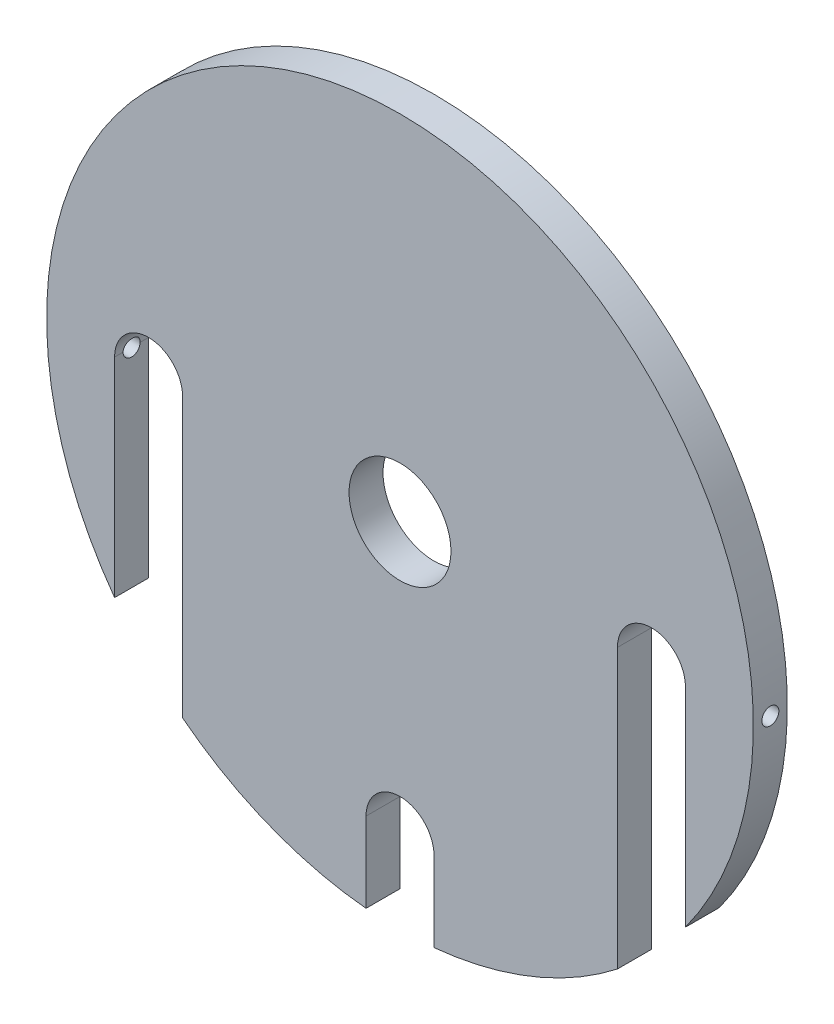
ISO-10303-21;
HEADER;
FILE_DESCRIPTION(('STEP AP214'),'2;1');
FILE_NAME('part.step','',(''),(''),'','','');
FILE_SCHEMA(('AUTOMOTIVE_DESIGN { 1 0 10303 214 1 1 1 1 }'));
ENDSEC;
DATA;
#1=APPLICATION_CONTEXT('core data for automotive mechanical design processes');
#2=APPLICATION_PROTOCOL_DEFINITION('international standard','automotive_design',2000,#1);
#3=PRODUCT_CONTEXT('',#1,'mechanical');
#4=PRODUCT('Part','Part','',(#3));
#5=PRODUCT_RELATED_PRODUCT_CATEGORY('part','',(#4));
#6=PRODUCT_DEFINITION_FORMATION('','',#4);
#7=PRODUCT_DEFINITION_CONTEXT('part definition',#1,'design');
#8=PRODUCT_DEFINITION('design','',#6,#7);
#9=PRODUCT_DEFINITION_SHAPE('','',#8);
#10=(LENGTH_UNIT() NAMED_UNIT(*) SI_UNIT(.MILLI.,.METRE.));
#11=(NAMED_UNIT(*) PLANE_ANGLE_UNIT() SI_UNIT($,.RADIAN.));
#12=(NAMED_UNIT(*) SI_UNIT($,.STERADIAN.) SOLID_ANGLE_UNIT());
#13=UNCERTAINTY_MEASURE_WITH_UNIT(LENGTH_MEASURE(1.E-05),#10,'distance_accuracy_value','');
#14=(GEOMETRIC_REPRESENTATION_CONTEXT(3) GLOBAL_UNCERTAINTY_ASSIGNED_CONTEXT((#13)) GLOBAL_UNIT_ASSIGNED_CONTEXT((#10,
#11,#12)) REPRESENTATION_CONTEXT('',''));
#15=CARTESIAN_POINT('',(0.,0.,0.));
#16=DIRECTION('',(0.,0.,1.));
#17=DIRECTION('',(1.,0.,0.));
#18=AXIS2_PLACEMENT_3D('',#15,#16,#17);
#19=CARTESIAN_POINT('',(0.,0.,5.));
#20=DIRECTION('',(0.,0.,-1.));
#21=DIRECTION('',(-1.,0.,0.));
#22=AXIS2_PLACEMENT_3D('',#19,#20,#21);
#23=CYLINDRICAL_SURFACE('',#22,52.);
#24=CARTESIAN_POINT('',(-52.,0.,3.74999999999997));
#25=CARTESIAN_POINT('',(-51.9999997973088,-0.0702021682400464,3.74999687992933));
#26=CARTESIAN_POINT('',(-51.9998563106322,-0.140454980639137,3.74406611765067));
#27=CARTESIAN_POINT('',(-51.9992977077108,-0.279025058393827,3.72048986893196));
#28=CARTESIAN_POINT('',(-51.9988822661217,-0.347339903067153,3.70283035081474));
#29=CARTESIAN_POINT('',(-51.9978268064074,-0.480006508188222,3.65630027639843));
#30=CARTESIAN_POINT('',(-51.99718689723,-0.544360173457295,3.62743515813433));
#31=CARTESIAN_POINT('',(-51.9957547051507,-0.667290304712366,3.5593209406979));
#32=CARTESIAN_POINT('',(-51.9949624597062,-0.725868185533344,3.5200743932767));
#33=CARTESIAN_POINT('',(-51.993314512565,-0.835622237615812,3.43229506993562));
#34=CARTESIAN_POINT('',(-51.9924587928453,-0.886796294336812,3.38375965026051));
#35=CARTESIAN_POINT('',(-51.9907805029649,-0.980272412733882,3.27878450935077));
#36=CARTESIAN_POINT('',(-51.9899579341188,-1.02257412284458,3.22234447504473));
#37=CARTESIAN_POINT('',(-51.9884386397818,-1.09710649502679,3.10315638642818));
#38=CARTESIAN_POINT('',(-51.9877419271968,-1.1293361245001,3.04040768621896));
#39=CARTESIAN_POINT('',(-51.9865530421198,-1.18280263413753,2.91038812575776));
#40=CARTESIAN_POINT('',(-51.986060868954,-1.2040395505159,2.84311728040431));
#41=CARTESIAN_POINT('',(-51.9853366693591,-1.23491389903223,2.70597678620698));
#42=CARTESIAN_POINT('',(-51.9851045924863,-1.24455358038817,2.63610764399878));
#43=CARTESIAN_POINT('',(-51.984926600554,-1.25196674319694,2.49574247865659));
#44=CARTESIAN_POINT('',(-51.9849806845764,-1.24974026271388,2.42524645753422));
#45=CARTESIAN_POINT('',(-51.9853688684599,-1.2334862311866,2.28564392519228));
#46=CARTESIAN_POINT('',(-51.9857029104753,-1.21946111800725,2.21653712994719));
#47=CARTESIAN_POINT('',(-51.9866132614739,-1.18001170891155,2.08165919058869));
#48=CARTESIAN_POINT('',(-51.9871895708913,-1.15458739256979,2.01588805245243));
#49=CARTESIAN_POINT('',(-51.9885195538747,-1.09305848724996,1.88954063363324));
#50=CARTESIAN_POINT('',(-51.9892732460073,-1.05695278015017,1.82896489765869));
#51=CARTESIAN_POINT('',(-51.9908730077096,-0.97508685050708,1.71473380837822));
#52=CARTESIAN_POINT('',(-51.9917190774014,-0.929326615196248,1.66107846422425));
#53=CARTESIAN_POINT('',(-51.9934084710292,-0.829436795191524,1.56219702559578));
#54=CARTESIAN_POINT('',(-51.9942517942158,-0.775305094379052,1.5169730687793));
#55=CARTESIAN_POINT('',(-51.9958404163556,-0.66021642734381,1.43625461494275));
#56=CARTESIAN_POINT('',(-51.9965857152941,-0.599259460100227,1.40076011937787));
#57=CARTESIAN_POINT('',(-51.9978942759528,-0.472249452633566,1.34050840716626));
#58=CARTESIAN_POINT('',(-51.9984575365614,-0.406196381297413,1.31575125607999));
#59=CARTESIAN_POINT('',(-51.999338504944,-0.270869723303465,1.27767836334556));
#60=CARTESIAN_POINT('',(-51.999656213151,-0.2015961423257,1.26436260151896));
#61=CARTESIAN_POINT('',(-52.0000102063582,-0.061813484909492,1.24955309245813));
#62=CARTESIAN_POINT('',(-52.0000465617606,0.00869527802579338,1.24805638776463));
#63=CARTESIAN_POINT('',(-51.9998339373793,0.148963101488766,1.2569197746246));
#64=CARTESIAN_POINT('',(-51.9995849578032,0.218722162561868,1.26727985755157));
#65=CARTESIAN_POINT('',(-51.9988297727829,0.355502118047405,1.29956028456227));
#66=CARTESIAN_POINT('',(-51.9983235971799,0.422523329145396,1.32147928752947));
#67=CARTESIAN_POINT('',(-51.9971110688426,0.551934790106642,1.37625398512122));
#68=CARTESIAN_POINT('',(-51.9964047158591,0.614325034204478,1.40910969336138));
#69=CARTESIAN_POINT('',(-51.9948712519192,0.732717131318693,1.48483276088721));
#70=CARTESIAN_POINT('',(-51.9940441169541,0.788717710263129,1.52770211167582));
#71=CARTESIAN_POINT('',(-51.9923623996813,0.892728024943149,1.62223262873549));
#72=CARTESIAN_POINT('',(-51.9915078173245,0.940737746423562,1.67389381069027));
#73=CARTESIAN_POINT('',(-51.9898673476523,1.02741336637545,1.78455416895));
#74=CARTESIAN_POINT('',(-51.9890814743874,1.06607735654153,1.84355484018678));
#75=CARTESIAN_POINT('',(-51.9876672469856,1.1329509148134,1.96721168227525));
#76=CARTESIAN_POINT('',(-51.987038892561,1.16116050200276,2.03186784280308));
#77=CARTESIAN_POINT('',(-51.9860106472865,1.20632115233112,2.16499310229294));
#78=CARTESIAN_POINT('',(-51.9856107312901,1.22327345470781,2.2334617806612));
#79=CARTESIAN_POINT('',(-51.9850843807901,1.24544238931521,2.37227450012035));
#80=CARTESIAN_POINT('',(-51.9849579463086,1.25065902059229,2.44261854136364));
#81=CARTESIAN_POINT('',(-51.9849928232249,1.24920837205708,2.58316596950844));
#82=CARTESIAN_POINT('',(-51.9851540615811,1.24254410886215,2.65336938758407));
#83=CARTESIAN_POINT('',(-51.9857459536922,1.21752703248411,2.79166069234159));
#84=CARTESIAN_POINT('',(-51.9861766079842,1.19917419599695,2.85974857480534));
#85=CARTESIAN_POINT('',(-51.987258775318,1.15130120148205,2.9918775864388));
#86=CARTESIAN_POINT('',(-51.9879102922615,1.12178084616813,3.05591864409367));
#87=CARTESIAN_POINT('',(-51.9893607059864,1.05241228363552,3.17813395549261));
#88=CARTESIAN_POINT('',(-51.9901595972744,1.01256446135625,3.2363084277918));
#89=CARTESIAN_POINT('',(-51.9918148774004,0.923664953375486,3.34515199363518));
#90=CARTESIAN_POINT('',(-51.9926712747011,0.874611911118666,3.39581997899113));
#91=CARTESIAN_POINT('',(-51.9943451600046,0.768681430122398,3.48821510346305));
#92=CARTESIAN_POINT('',(-51.9951626383074,0.711802054372354,3.52994002261884));
#93=CARTESIAN_POINT('',(-51.9966667559422,0.591815694736752,3.60326923068736));
#94=CARTESIAN_POINT('',(-51.9973533182103,0.528705075788599,3.6348675659721));
#95=CARTESIAN_POINT('',(-51.9985167522864,0.398121943458331,3.68698349979239));
#96=CARTESIAN_POINT('',(-51.9989938744938,0.330654750008821,3.70751433698225));
#97=CARTESIAN_POINT('',(-51.9995568847121,0.218966675963328,3.73146049353979));
#98=CARTESIAN_POINT('',(-51.9997223338047,0.175471024400522,3.7384040917347));
#99=CARTESIAN_POINT('',(-51.9999439549651,0.0879902148647551,3.747674822414));
#100=CARTESIAN_POINT('',(-52.0000001270536,0.0440050569835983,3.75000195576416));
#101=CARTESIAN_POINT('',(-52.,0.,3.74999999999997));
#102=B_SPLINE_CURVE_WITH_KNOTS('',3,(#24,#25,#26,#27,#28,#29,#30,#31,#32,#33,#34,#35,#36,#37,
#38,#39,#40,#41,#42,#43,#44,#45,#46,#47,#48,#49,#50,#51,#52,#53,#54,#55,#56,#57,#58,#59,#60,#61,
#62,#63,#64,#65,#66,#67,#68,#69,#70,#71,#72,#73,#74,#75,#76,#77,#78,#79,#80,#81,#82,#83,#84,#85,
#86,#87,#88,#89,#90,#91,#92,#93,#94,#95,#96,#97,#98,#99,#100,#101),.UNSPECIFIED.,.T.,.F.,(4,2,2,
2,2,2,2,2,2,2,2,2,2,2,2,2,2,2,2,2,2,2,2,2,2,2,2,2,2,2,2,2,2,2,2,2,2,2,4),(0.,0.210445882642419,
0.421143986460032,0.631739966859021,0.842284230874119,1.05288850836603,1.26350112944419,
1.47413533562782,1.68476884789616,1.89536150239966,2.1059534813672,2.31650195794423,
2.52705081178931,2.73762171356832,2.94819289381639,3.15881738899728,3.36944191567997,
3.58006772838335,3.79069316961885,4.00126590479645,4.21183848677015,4.42238664256405,
4.63293506047981,4.84352538775412,5.05411609070383,5.26474975792468,5.47538304065057,
5.68599313234982,5.89660324116312,6.10715988265278,6.3177169439403,6.5282777251176,
6.73883065911478,6.94941464628901,7.16005084687811,7.37081065862462,7.58131780235904,
7.71323231478191,7.84514680246522),.UNSPECIFIED.);
#103=CARTESIAN_POINT('',(-52.,0.,3.74999999999997));
#104=VERTEX_POINT('',#103);
#105=EDGE_CURVE('E151',#104,#104,#102,.T.);
#106=ORIENTED_EDGE('',*,*,#105,.T.);
#107=EDGE_LOOP('',(#106));
#108=FACE_BOUND('',#107,.T.);
#109=CARTESIAN_POINT('',(52.,0.,1.25000000000002));
#110=CARTESIAN_POINT('',(51.9999997973088,-0.0702021682400463,1.25000312007066));
#111=CARTESIAN_POINT('',(51.9998563106322,-0.140454980639137,1.25593388234932));
#112=CARTESIAN_POINT('',(51.9992977077108,-0.279025058393826,1.27951013106803));
#113=CARTESIAN_POINT('',(51.9988822661217,-0.347339903067152,1.29716964918525));
#114=CARTESIAN_POINT('',(51.9978268064074,-0.480006508188221,1.34369972360156));
#115=CARTESIAN_POINT('',(51.99718689723,-0.544360173457294,1.37256484186566));
#116=CARTESIAN_POINT('',(51.9957547051507,-0.667290304712365,1.44067905930209));
#117=CARTESIAN_POINT('',(51.9949624597062,-0.725868185533343,1.47992560672329));
#118=CARTESIAN_POINT('',(51.993314512565,-0.83562223761581,1.56770493006437));
#119=CARTESIAN_POINT('',(51.9924587928453,-0.88679629433681,1.61624034973948));
#120=CARTESIAN_POINT('',(51.9907805029649,-0.980272412733881,1.72121549064922));
#121=CARTESIAN_POINT('',(51.9899579341188,-1.02257412284458,1.77765552495526));
#122=CARTESIAN_POINT('',(51.9884386397818,-1.09710649502679,1.89684361357181));
#123=CARTESIAN_POINT('',(51.9877419271968,-1.1293361245001,1.95959231378103));
#124=CARTESIAN_POINT('',(51.9865530421198,-1.18280263413752,2.08961187424223));
#125=CARTESIAN_POINT('',(51.986060868954,-1.2040395505159,2.15688271959568));
#126=CARTESIAN_POINT('',(51.9853366693591,-1.23491389903222,2.294023213793));
#127=CARTESIAN_POINT('',(51.9851045924863,-1.24455358038817,2.36389235600121));
#128=CARTESIAN_POINT('',(51.984926600554,-1.25196674319694,2.5042575213434));
#129=CARTESIAN_POINT('',(51.9849806845764,-1.24974026271388,2.57475354246577));
#130=CARTESIAN_POINT('',(51.9853688684599,-1.2334862311866,2.7143560748077));
#131=CARTESIAN_POINT('',(51.9857029104753,-1.21946111800725,2.78346287005279));
#132=CARTESIAN_POINT('',(51.9866132614739,-1.18001170891155,2.9183408094113));
#133=CARTESIAN_POINT('',(51.9871895708913,-1.15458739256979,2.98411194754756));
#134=CARTESIAN_POINT('',(51.9885195538747,-1.09305848724996,3.11045936636675));
#135=CARTESIAN_POINT('',(51.9892732460073,-1.05695278015017,3.1710351023413));
#136=CARTESIAN_POINT('',(51.9908730077096,-0.97508685050708,3.28526619162177));
#137=CARTESIAN_POINT('',(51.9917190774014,-0.929326615196247,3.33892153577574));
#138=CARTESIAN_POINT('',(51.9934084710292,-0.829436795191523,3.4378029744042));
#139=CARTESIAN_POINT('',(51.9942517942158,-0.775305094379052,3.48302693122069));
#140=CARTESIAN_POINT('',(51.9958404163556,-0.66021642734381,3.56374538505724));
#141=CARTESIAN_POINT('',(51.9965857152941,-0.599259460100227,3.59923988062212));
#142=CARTESIAN_POINT('',(51.9978942759528,-0.472249452633566,3.65949159283373));
#143=CARTESIAN_POINT('',(51.9984575365614,-0.406196381297413,3.68424874392));
#144=CARTESIAN_POINT('',(51.999338504944,-0.270869723303465,3.72232163665443));
#145=CARTESIAN_POINT('',(51.9996562131511,-0.201596142325701,3.73563739848103));
#146=CARTESIAN_POINT('',(52.0000102063582,-0.0618134849094924,3.75044690754186));
#147=CARTESIAN_POINT('',(52.0000465617606,0.00869527802579271,3.75194361223536));
#148=CARTESIAN_POINT('',(51.9998339373793,0.148963101488765,3.74308022537539));
#149=CARTESIAN_POINT('',(51.9995849578032,0.218722162561867,3.73272014244842));
#150=CARTESIAN_POINT('',(51.9988297727829,0.355502118047404,3.70043971543772));
#151=CARTESIAN_POINT('',(51.9983235971799,0.422523329145395,3.67852071247052));
#152=CARTESIAN_POINT('',(51.9971110688426,0.55193479010664,3.62374601487876));
#153=CARTESIAN_POINT('',(51.9964047158591,0.614325034204477,3.59089030663861));
#154=CARTESIAN_POINT('',(51.9948712519192,0.732717131318691,3.51516723911277));
#155=CARTESIAN_POINT('',(51.9940441169541,0.788717710263128,3.47229788832416));
#156=CARTESIAN_POINT('',(51.9923623996813,0.892728024943147,3.3777673712645));
#157=CARTESIAN_POINT('',(51.9915078173245,0.940737746423561,3.32610618930972));
#158=CARTESIAN_POINT('',(51.9898673476523,1.02741336637545,3.21544583104999));
#159=CARTESIAN_POINT('',(51.9890814743874,1.06607735654153,3.15644515981321));
#160=CARTESIAN_POINT('',(51.9876672469856,1.13295091481339,3.03278831772474));
#161=CARTESIAN_POINT('',(51.987038892561,1.16116050200276,2.96813215719691));
#162=CARTESIAN_POINT('',(51.9860106472865,1.20632115233112,2.83500689770705));
#163=CARTESIAN_POINT('',(51.9856107312901,1.22327345470781,2.76653821933879));
#164=CARTESIAN_POINT('',(51.9850843807901,1.24544238931521,2.62772549987964));
#165=CARTESIAN_POINT('',(51.9849579463086,1.25065902059229,2.55738145863635));
#166=CARTESIAN_POINT('',(51.9849928232249,1.24920837205708,2.41683403049155));
#167=CARTESIAN_POINT('',(51.9851540615811,1.24254410886215,2.34663061241592));
#168=CARTESIAN_POINT('',(51.9857459536922,1.21752703248411,2.2083393076584));
#169=CARTESIAN_POINT('',(51.9861766079842,1.19917419599694,2.14025142519465));
#170=CARTESIAN_POINT('',(51.987258775318,1.15130120148205,2.00812241356119));
#171=CARTESIAN_POINT('',(51.9879102922615,1.12178084616813,1.94408135590632));
#172=CARTESIAN_POINT('',(51.9893607059864,1.05241228363552,1.82186604450738));
#173=CARTESIAN_POINT('',(51.9901595972744,1.01256446135625,1.76369157220819));
#174=CARTESIAN_POINT('',(51.9918148774004,0.923664953375485,1.65484800636481));
#175=CARTESIAN_POINT('',(51.9926712747011,0.874611911118665,1.60418002100886));
#176=CARTESIAN_POINT('',(51.9943451600046,0.768681430122397,1.51178489653694));
#177=CARTESIAN_POINT('',(51.9951626383074,0.711802054372353,1.47005997738115));
#178=CARTESIAN_POINT('',(51.9966667559422,0.591815694736752,1.39673076931263));
#179=CARTESIAN_POINT('',(51.9973533182103,0.528705075788598,1.36513243402789));
#180=CARTESIAN_POINT('',(51.9985167522864,0.398121943458331,1.3130165002076));
#181=CARTESIAN_POINT('',(51.9989938744938,0.330654750008821,1.29248566301774));
#182=CARTESIAN_POINT('',(51.9995568847121,0.218966675963328,1.2685395064602));
#183=CARTESIAN_POINT('',(51.9997223338047,0.175471024400522,1.26159590826529));
#184=CARTESIAN_POINT('',(51.9999439549651,0.0879902148647552,1.25232517758599));
#185=CARTESIAN_POINT('',(52.0000001270536,0.0440050569835984,1.24999804423583));
#186=CARTESIAN_POINT('',(52.,0.,1.25000000000002));
#187=B_SPLINE_CURVE_WITH_KNOTS('',3,(#109,#110,#111,#112,#113,#114,#115,#116,#117,#118,#119,
#120,#121,#122,#123,#124,#125,#126,#127,#128,#129,#130,#131,#132,#133,#134,#135,#136,#137,#138,
#139,#140,#141,#142,#143,#144,#145,#146,#147,#148,#149,#150,#151,#152,#153,#154,#155,#156,#157,
#158,#159,#160,#161,#162,#163,#164,#165,#166,#167,#168,#169,#170,#171,#172,#173,#174,#175,#176,
#177,#178,#179,#180,#181,#182,#183,#184,#185,#186),.UNSPECIFIED.,.T.,.F.,(4,2,2,2,2,2,2,2,2,2,2,
2,2,2,2,2,2,2,2,2,2,2,2,2,2,2,2,2,2,2,2,2,2,2,2,2,2,2,4),(0.,0.210445882642419,
0.421143986460031,0.631739966859019,0.842284230874118,1.05288850836602,1.26350112944418,
1.47413533562781,1.68476884789615,1.89536150239966,2.1059534813672,2.31650195794423,
2.52705081178931,2.73762171356831,2.94819289381639,3.15881738899727,3.36944191567997,
3.58006772838335,3.79069316961885,4.00126590479644,4.21183848677015,4.42238664256404,
4.63293506047981,4.84352538775411,5.05411609070383,5.26474975792467,5.47538304065056,
5.68599313234981,5.89660324116311,6.10715988265277,6.31771694394029,6.52827772511759,
6.73883065911477,6.94941464628899,7.1600508468781,7.37081065862461,7.58131780235903,
7.7132323147819,7.84514680246521),.UNSPECIFIED.);
#188=CARTESIAN_POINT('',(52.,0.,1.25000000000002));
#189=VERTEX_POINT('',#188);
#190=EDGE_CURVE('E257',#189,#189,#187,.T.);
#191=ORIENTED_EDGE('',*,*,#190,.T.);
#192=EDGE_LOOP('',(#191));
#193=FACE_BOUND('',#192,.T.);
#194=CARTESIAN_POINT('',(0.,0.,5.));
#195=DIRECTION('',(0.,0.,1.));
#196=DIRECTION('',(1.,0.,0.));
#197=AXIS2_PLACEMENT_3D('',#194,#195,#196);
#198=CIRCLE('',#197,52.);
#199=CARTESIAN_POINT('',(42.,-30.6594194335118,5.));
#200=VERTEX_POINT('',#199);
#201=CARTESIAN_POINT('',(-42.,-30.6594194335118,5.));
#202=VERTEX_POINT('',#201);
#203=EDGE_CURVE('E198',#200,#202,#198,.T.);
#204=ORIENTED_EDGE('',*,*,#203,.F.);
#205=DIRECTION('',(0.,0.,-1.));
#206=VECTOR('',#205,1.);
#207=CARTESIAN_POINT('',(42.,-30.6594194335118,5.));
#208=LINE('',#207,#206);
#209=CARTESIAN_POINT('',(42.,-30.6594194335118,0.));
#210=VERTEX_POINT('',#209);
#211=EDGE_CURVE('E194',#200,#210,#208,.T.);
#212=ORIENTED_EDGE('',*,*,#211,.T.);
#213=CARTESIAN_POINT('',(0.,0.,0.));
#214=DIRECTION('',(0.,0.,1.));
#215=DIRECTION('',(1.,0.,0.));
#216=AXIS2_PLACEMENT_3D('',#213,#214,#215);
#217=CIRCLE('',#216,52.);
#218=CARTESIAN_POINT('',(-42.,-30.6594194335118,0.));
#219=VERTEX_POINT('',#218);
#220=EDGE_CURVE('E197',#210,#219,#217,.T.);
#221=ORIENTED_EDGE('',*,*,#220,.T.);
#222=DIRECTION('',(0.,0.,-1.));
#223=VECTOR('',#222,1.);
#224=CARTESIAN_POINT('',(-42.,-30.6594194335118,5.));
#225=LINE('',#224,#223);
#226=EDGE_CURVE('E185',#219,#202,#225,.F.);
#227=ORIENTED_EDGE('',*,*,#226,.T.);
#228=EDGE_LOOP('',(#204,#212,#221,#227));
#229=FACE_BOUND('',#228,.T.);
#230=ADVANCED_FACE('F39',(#108,#193,#229),#23,.T.);
#231=CARTESIAN_POINT('',(-32.,-40.9878030638384,5.));
#232=VERTEX_POINT('',#231);
#233=CARTESIAN_POINT('',(-5.,-51.7590571784301,5.));
#234=VERTEX_POINT('',#233);
#235=EDGE_CURVE('E203',#232,#234,#198,.T.);
#236=ORIENTED_EDGE('',*,*,#235,.F.);
#237=DIRECTION('',(0.,0.,-1.));
#238=VECTOR('',#237,1.);
#239=CARTESIAN_POINT('',(-32.,-40.9878030638384,5.));
#240=LINE('',#239,#238);
#241=CARTESIAN_POINT('',(-32.,-40.9878030638384,0.));
#242=VERTEX_POINT('',#241);
#243=EDGE_CURVE('E188',#232,#242,#240,.T.);
#244=ORIENTED_EDGE('',*,*,#243,.T.);
#245=CARTESIAN_POINT('',(-5.,-51.7590571784301,0.));
#246=VERTEX_POINT('',#245);
#247=EDGE_CURVE('E202',#242,#246,#217,.T.);
#248=ORIENTED_EDGE('',*,*,#247,.T.);
#249=DIRECTION('',(0.,0.,-1.));
#250=VECTOR('',#249,1.);
#251=CARTESIAN_POINT('',(-5.,-51.7590571784301,5.));
#252=LINE('',#251,#250);
#253=EDGE_CURVE('E178',#246,#234,#252,.F.);
#254=ORIENTED_EDGE('',*,*,#253,.T.);
#255=EDGE_LOOP('',(#236,#244,#248,#254));
#256=FACE_BOUND('',#255,.T.);
#257=ADVANCED_FACE('F251',(#256),#23,.T.);
#258=CARTESIAN_POINT('',(5.,-51.7590571784301,0.));
#259=VERTEX_POINT('',#258);
#260=CARTESIAN_POINT('',(32.,-40.9878030638384,0.));
#261=VERTEX_POINT('',#260);
#262=EDGE_CURVE('E206',#259,#261,#217,.T.);
#263=ORIENTED_EDGE('',*,*,#262,.T.);
#264=DIRECTION('',(0.,0.,-1.));
#265=VECTOR('',#264,1.);
#266=CARTESIAN_POINT('',(32.,-40.9878030638384,5.));
#267=LINE('',#266,#265);
#268=CARTESIAN_POINT('',(32.,-40.9878030638384,5.));
#269=VERTEX_POINT('',#268);
#270=EDGE_CURVE('E191',#261,#269,#267,.F.);
#271=ORIENTED_EDGE('',*,*,#270,.T.);
#272=CARTESIAN_POINT('',(5.,-51.7590571784301,5.));
#273=VERTEX_POINT('',#272);
#274=EDGE_CURVE('E201',#273,#269,#198,.T.);
#275=ORIENTED_EDGE('',*,*,#274,.F.);
#276=DIRECTION('',(0.,0.,-1.));
#277=VECTOR('',#276,1.);
#278=CARTESIAN_POINT('',(5.,-51.7590571784301,5.));
#279=LINE('',#278,#277);
#280=EDGE_CURVE('E181',#273,#259,#279,.T.);
#281=ORIENTED_EDGE('',*,*,#280,.T.);
#282=EDGE_LOOP('',(#263,#271,#275,#281));
#283=FACE_BOUND('',#282,.T.);
#284=ADVANCED_FACE('F246',(#283),#23,.T.);
#285=CARTESIAN_POINT('',(0.,0.,5.));
#286=DIRECTION('',(0.,0.,1.));
#287=DIRECTION('',(1.,0.,0.));
#288=AXIS2_PLACEMENT_3D('',#285,#286,#287);
#289=PLANE('',#288);
#290=CARTESIAN_POINT('',(0.,0.,5.));
#291=DIRECTION('',(0.,0.,1.));
#292=DIRECTION('',(1.,0.,0.));
#293=AXIS2_PLACEMENT_3D('',#290,#291,#292);
#294=CIRCLE('',#293,7.5);
#295=CARTESIAN_POINT('',(7.5,0.,5.));
#296=VERTEX_POINT('',#295);
#297=EDGE_CURVE('E235',#296,#296,#294,.T.);
#298=ORIENTED_EDGE('',*,*,#297,.F.);
#299=EDGE_LOOP('',(#298));
#300=FACE_BOUND('',#299,.T.);
#301=DIRECTION('',(0.,1.,0.));
#302=VECTOR('',#301,1.);
#303=CARTESIAN_POINT('',(42.,3.54103707564824E-07,5.));
#304=LINE('',#303,#302);
#305=CARTESIAN_POINT('',(42.,3.54103706807145E-07,5.));
#306=VERTEX_POINT('',#305);
#307=EDGE_CURVE('E305',#200,#306,#304,.T.);
#308=ORIENTED_EDGE('',*,*,#307,.F.);
#309=ORIENTED_EDGE('',*,*,#203,.T.);
#310=DIRECTION('',(0.,-1.,0.));
#311=VECTOR('',#310,1.);
#312=CARTESIAN_POINT('',(-42.,3.54103707564824E-07,5.));
#313=LINE('',#312,#311);
#314=CARTESIAN_POINT('',(-42.,3.54103707564824E-07,5.));
#315=VERTEX_POINT('',#314);
#316=EDGE_CURVE('E161',#315,#202,#313,.T.);
#317=ORIENTED_EDGE('',*,*,#316,.F.);
#318=CARTESIAN_POINT('',(-37.,0.,5.));
#319=DIRECTION('',(0.,0.,1.));
#320=DIRECTION('',(1.,0.,0.));
#321=AXIS2_PLACEMENT_3D('',#318,#319,#320);
#322=CIRCLE('',#321,5.00000000000001);
#323=CARTESIAN_POINT('',(-32.,0.,5.));
#324=VERTEX_POINT('',#323);
#325=EDGE_CURVE('E155',#324,#315,#322,.T.);
#326=ORIENTED_EDGE('',*,*,#325,.F.);
#327=DIRECTION('',(0.,1.,0.));
#328=VECTOR('',#327,1.);
#329=CARTESIAN_POINT('',(-32.,0.,5.));
#330=LINE('',#329,#328);
#331=EDGE_CURVE('E157',#232,#324,#330,.T.);
#332=ORIENTED_EDGE('',*,*,#331,.F.);
#333=ORIENTED_EDGE('',*,*,#235,.T.);
#334=DIRECTION('',(0.,-1.,0.));
#335=VECTOR('',#334,1.);
#336=CARTESIAN_POINT('',(-5.,-39.9999996458963,5.));
#337=LINE('',#336,#335);
#338=CARTESIAN_POINT('',(-5.,-39.9999996458963,5.));
#339=VERTEX_POINT('',#338);
#340=EDGE_CURVE('E171',#339,#234,#337,.T.);
#341=ORIENTED_EDGE('',*,*,#340,.F.);
#342=CARTESIAN_POINT('',(0.,-40.,5.));
#343=DIRECTION('',(0.,0.,1.));
#344=DIRECTION('',(1.,0.,0.));
#345=AXIS2_PLACEMENT_3D('',#342,#343,#344);
#346=CIRCLE('',#345,5.00000000000001);
#347=CARTESIAN_POINT('',(5.00000000000001,-40.,5.));
#348=VERTEX_POINT('',#347);
#349=EDGE_CURVE('E167',#348,#339,#346,.T.);
#350=ORIENTED_EDGE('',*,*,#349,.F.);
#351=DIRECTION('',(0.,1.,0.));
#352=VECTOR('',#351,1.);
#353=CARTESIAN_POINT('',(5.00000000000001,-40.,5.));
#354=LINE('',#353,#352);
#355=EDGE_CURVE('E165',#273,#348,#354,.T.);
#356=ORIENTED_EDGE('',*,*,#355,.F.);
#357=ORIENTED_EDGE('',*,*,#274,.T.);
#358=DIRECTION('',(0.,-1.,0.));
#359=VECTOR('',#358,1.);
#360=CARTESIAN_POINT('',(32.,0.,5.));
#361=LINE('',#360,#359);
#362=CARTESIAN_POINT('',(32.,0.,5.));
#363=VERTEX_POINT('',#362);
#364=EDGE_CURVE('E311',#363,#269,#361,.T.);
#365=ORIENTED_EDGE('',*,*,#364,.F.);
#366=CARTESIAN_POINT('',(37.,0.,5.));
#367=DIRECTION('',(0.,0.,1.));
#368=DIRECTION('',(-1.,0.,0.));
#369=AXIS2_PLACEMENT_3D('',#366,#367,#368);
#370=CIRCLE('',#369,5.00000000000001);
#371=EDGE_CURVE('E308',#306,#363,#370,.T.);
#372=ORIENTED_EDGE('',*,*,#371,.F.);
#373=EDGE_LOOP('',(#308,#309,#317,#326,#332,#333,#341,#350,#356,#357,#365,#372));
#374=FACE_BOUND('',#373,.T.);
#375=ADVANCED_FACE('F250',(#300,#374),#289,.T.);
#376=CARTESIAN_POINT('',(0.,0.,0.));
#377=DIRECTION('',(0.,0.,1.));
#378=DIRECTION('',(1.,0.,0.));
#379=AXIS2_PLACEMENT_3D('',#376,#377,#378);
#380=PLANE('',#379);
#381=CARTESIAN_POINT('',(0.,0.,0.));
#382=DIRECTION('',(0.,0.,1.));
#383=DIRECTION('',(1.,0.,0.));
#384=AXIS2_PLACEMENT_3D('',#381,#382,#383);
#385=CIRCLE('',#384,7.5);
#386=CARTESIAN_POINT('',(7.5,0.,0.));
#387=VERTEX_POINT('',#386);
#388=EDGE_CURVE('E168',#387,#387,#385,.T.);
#389=ORIENTED_EDGE('',*,*,#388,.T.);
#390=EDGE_LOOP('',(#389));
#391=FACE_BOUND('',#390,.T.);
#392=ORIENTED_EDGE('',*,*,#220,.F.);
#393=DIRECTION('',(0.,1.,0.));
#394=VECTOR('',#393,1.);
#395=CARTESIAN_POINT('',(42.,0.,0.));
#396=LINE('',#395,#394);
#397=CARTESIAN_POINT('',(42.,3.54103706807145E-07,0.));
#398=VERTEX_POINT('',#397);
#399=EDGE_CURVE('E231',#210,#398,#396,.T.);
#400=ORIENTED_EDGE('',*,*,#399,.T.);
#401=CARTESIAN_POINT('',(37.,0.,0.));
#402=DIRECTION('',(0.,0.,1.));
#403=DIRECTION('',(1.,0.,0.));
#404=AXIS2_PLACEMENT_3D('',#401,#402,#403);
#405=CIRCLE('',#404,5.00000000000001);
#406=CARTESIAN_POINT('',(32.,0.,0.));
#407=VERTEX_POINT('',#406);
#408=EDGE_CURVE('E225',#398,#407,#405,.T.);
#409=ORIENTED_EDGE('',*,*,#408,.T.);
#410=DIRECTION('',(0.,-1.,0.));
#411=VECTOR('',#410,1.);
#412=CARTESIAN_POINT('',(32.,0.,0.));
#413=LINE('',#412,#411);
#414=EDGE_CURVE('E228',#407,#261,#413,.T.);
#415=ORIENTED_EDGE('',*,*,#414,.T.);
#416=ORIENTED_EDGE('',*,*,#262,.F.);
#417=DIRECTION('',(0.,1.,0.));
#418=VECTOR('',#417,1.);
#419=CARTESIAN_POINT('',(5.00000000000005,0.,0.));
#420=LINE('',#419,#418);
#421=CARTESIAN_POINT('',(5.00000000000001,-40.,0.));
#422=VERTEX_POINT('',#421);
#423=EDGE_CURVE('E213',#259,#422,#420,.T.);
#424=ORIENTED_EDGE('',*,*,#423,.T.);
#425=CARTESIAN_POINT('',(0.,-40.,0.));
#426=DIRECTION('',(0.,0.,1.));
#427=DIRECTION('',(1.,0.,0.));
#428=AXIS2_PLACEMENT_3D('',#425,#426,#427);
#429=CIRCLE('',#428,5.00000000000001);
#430=CARTESIAN_POINT('',(-5.,-39.9999996458963,0.));
#431=VERTEX_POINT('',#430);
#432=EDGE_CURVE('E207',#422,#431,#429,.T.);
#433=ORIENTED_EDGE('',*,*,#432,.T.);
#434=DIRECTION('',(0.,-1.,0.));
#435=VECTOR('',#434,1.);
#436=CARTESIAN_POINT('',(-5.,0.,0.));
#437=LINE('',#436,#435);
#438=EDGE_CURVE('E210',#431,#246,#437,.T.);
#439=ORIENTED_EDGE('',*,*,#438,.T.);
#440=ORIENTED_EDGE('',*,*,#247,.F.);
#441=DIRECTION('',(0.,1.,0.));
#442=VECTOR('',#441,1.);
#443=CARTESIAN_POINT('',(-32.,0.,0.));
#444=LINE('',#443,#442);
#445=CARTESIAN_POINT('',(-32.,0.,0.));
#446=VERTEX_POINT('',#445);
#447=EDGE_CURVE('E222',#242,#446,#444,.T.);
#448=ORIENTED_EDGE('',*,*,#447,.T.);
#449=CARTESIAN_POINT('',(-37.,0.,0.));
#450=DIRECTION('',(0.,0.,1.));
#451=DIRECTION('',(1.,0.,0.));
#452=AXIS2_PLACEMENT_3D('',#449,#450,#451);
#453=CIRCLE('',#452,5.00000000000001);
#454=CARTESIAN_POINT('',(-42.,3.54103707564824E-07,0.));
#455=VERTEX_POINT('',#454);
#456=EDGE_CURVE('E219',#446,#455,#453,.T.);
#457=ORIENTED_EDGE('',*,*,#456,.T.);
#458=DIRECTION('',(0.,-1.,0.));
#459=VECTOR('',#458,1.);
#460=CARTESIAN_POINT('',(-42.,0.,0.));
#461=LINE('',#460,#459);
#462=EDGE_CURVE('E216',#455,#219,#461,.T.);
#463=ORIENTED_EDGE('',*,*,#462,.T.);
#464=EDGE_LOOP('',(#392,#400,#409,#415,#416,#424,#433,#439,#440,#448,#457,#463));
#465=FACE_BOUND('',#464,.T.);
#466=ADVANCED_FACE('F253',(#391,#465),#380,.F.);
#467=CARTESIAN_POINT('',(5.00000000000001,-40.,-5.));
#468=DIRECTION('',(1.,0.,0.));
#469=DIRECTION('',(0.,1.,0.));
#470=AXIS2_PLACEMENT_3D('',#467,#468,#469);
#471=PLANE('',#470);
#472=ORIENTED_EDGE('',*,*,#355,.T.);
#473=DIRECTION('',(0.,0.,1.));
#474=VECTOR('',#473,1.);
#475=CARTESIAN_POINT('',(5.00000000000001,-40.,-5.));
#476=LINE('',#475,#474);
#477=EDGE_CURVE('E173',#422,#348,#476,.T.);
#478=ORIENTED_EDGE('',*,*,#477,.F.);
#479=ORIENTED_EDGE('',*,*,#423,.F.);
#480=ORIENTED_EDGE('',*,*,#280,.F.);
#481=EDGE_LOOP('',(#472,#478,#479,#480));
#482=FACE_BOUND('',#481,.T.);
#483=ADVANCED_FACE('F346',(#482),#471,.F.);
#484=CARTESIAN_POINT('',(-5.,-39.9999996458963,-5.));
#485=DIRECTION('',(-1.,0.,0.));
#486=DIRECTION('',(0.,0.,1.));
#487=AXIS2_PLACEMENT_3D('',#484,#485,#486);
#488=PLANE('',#487);
#489=ORIENTED_EDGE('',*,*,#438,.F.);
#490=DIRECTION('',(0.,0.,1.));
#491=VECTOR('',#490,1.);
#492=CARTESIAN_POINT('',(-5.,-39.9999996458963,-5.));
#493=LINE('',#492,#491);
#494=EDGE_CURVE('E174',#431,#339,#493,.T.);
#495=ORIENTED_EDGE('',*,*,#494,.T.);
#496=ORIENTED_EDGE('',*,*,#340,.T.);
#497=ORIENTED_EDGE('',*,*,#253,.F.);
#498=EDGE_LOOP('',(#489,#495,#496,#497));
#499=FACE_BOUND('',#498,.T.);
#500=ADVANCED_FACE('F351',(#499),#488,.F.);
#501=CARTESIAN_POINT('',(0.,-40.,-5.));
#502=DIRECTION('',(0.,0.,1.));
#503=DIRECTION('',(1.,0.,0.));
#504=AXIS2_PLACEMENT_3D('',#501,#502,#503);
#505=CYLINDRICAL_SURFACE('',#504,5.00000000000001);
#506=ORIENTED_EDGE('',*,*,#477,.T.);
#507=ORIENTED_EDGE('',*,*,#349,.T.);
#508=ORIENTED_EDGE('',*,*,#494,.F.);
#509=ORIENTED_EDGE('',*,*,#432,.F.);
#510=EDGE_LOOP('',(#506,#507,#508,#509));
#511=FACE_BOUND('',#510,.T.);
#512=ADVANCED_FACE('F353',(#511),#505,.F.);
#513=CARTESIAN_POINT('',(-37.,0.,-5.));
#514=DIRECTION('',(0.,0.,1.));
#515=DIRECTION('',(1.,0.,0.));
#516=AXIS2_PLACEMENT_3D('',#513,#514,#515);
#517=CYLINDRICAL_SURFACE('',#516,5.00000000000001);
#518=DIRECTION('',(0.,0.,1.));
#519=VECTOR('',#518,1.);
#520=CARTESIAN_POINT('',(-42.,3.54103707564824E-07,-5.));
#521=LINE('',#520,#519);
#522=CARTESIAN_POINT('',(-42.,1.82161758190251E-07,3.74999999999999));
#523=VERTEX_POINT('',#522);
#524=EDGE_CURVE('E148',#523,#315,#521,.T.);
#525=ORIENTED_EDGE('',*,*,#524,.F.);
#526=CARTESIAN_POINT('',(-42.,3.54103706807145E-07,3.74999999999997));
#527=CARTESIAN_POINT('',(-42.0000019698079,0.0345962108447256,3.75000037120848));
#528=CARTESIAN_POINT('',(-41.9996404936237,0.0691749905615047,3.74856282406475));
#529=CARTESIAN_POINT('',(-41.998211646894,0.138075045025375,3.74283188041391));
#530=CARTESIAN_POINT('',(-41.9971443861335,0.172396358981764,3.7385389280655));
#531=CARTESIAN_POINT('',(-41.9929230925521,0.274465492973736,3.72143807063973));
#532=CARTESIAN_POINT('',(-41.988749315571,0.341513601197511,3.70440790316312));
#533=CARTESIAN_POINT('',(-41.9781308866131,0.471689346596805,3.65963557309653));
#534=CARTESIAN_POINT('',(-41.9716863200672,0.534817131156515,3.63189381349117));
#535=CARTESIAN_POINT('',(-41.9572127053964,0.655545907223673,3.56652304966058));
#536=CARTESIAN_POINT('',(-41.9491832895483,0.713145611465446,3.528891750152));
#537=CARTESIAN_POINT('',(-41.9322287226648,0.822334068204452,3.44400076801483));
#538=CARTESIAN_POINT('',(-41.9232898386111,0.873793125126095,3.39657707637418));
#539=CARTESIAN_POINT('',(-41.9056140885167,0.968120986197818,3.29379381453408));
#540=CARTESIAN_POINT('',(-41.8968772605609,1.01098818238927,3.23843276218429));
#541=CARTESIAN_POINT('',(-41.8804561903142,1.08752345234819,3.12033560905855));
#542=CARTESIAN_POINT('',(-41.8727894983175,1.12104552399413,3.05750222892854));
#543=CARTESIAN_POINT('',(-41.859578776577,1.17699881204663,2.92687265137997));
#544=CARTESIAN_POINT('',(-41.8540342986072,1.19943237071528,2.85907750552767));
#545=CARTESIAN_POINT('',(-41.8458372973129,1.23212906681595,2.72188100214124));
#546=CARTESIAN_POINT('',(-41.8431291004669,1.2426268597141,2.65253897137472));
#547=CARTESIAN_POINT('',(-41.8407446334443,1.25188502238948,2.51302759562177));
#548=CARTESIAN_POINT('',(-41.8410679384176,1.25064703687814,2.44285836793951));
#549=CARTESIAN_POINT('',(-41.8446600144865,1.23665556147121,2.30548634062433));
#550=CARTESIAN_POINT('',(-41.8478571843037,1.22418198646516,2.23825286658596));
#551=CARTESIAN_POINT('',(-41.856722600581,1.1885200687103,2.10686504396062));
#552=CARTESIAN_POINT('',(-41.8623910009486,1.16533105860175,2.042710887429));
#553=CARTESIAN_POINT('',(-41.875626004994,1.10865768092183,1.91855076405821));
#554=CARTESIAN_POINT('',(-41.8832112215834,1.07507158946569,1.85859329719128));
#555=CARTESIAN_POINT('',(-41.8994144444442,0.998629228017534,1.74506633204501));
#556=CARTESIAN_POINT('',(-41.9080326071173,0.955771553391181,1.6914978035923));
#557=CARTESIAN_POINT('',(-41.9256313199979,0.860558631115383,1.5906693379692));
#558=CARTESIAN_POINT('',(-41.9346152096698,0.80796814881437,1.54363186485354));
#559=CARTESIAN_POINT('',(-41.9517145197923,0.695522615188654,1.45899070019935));
#560=CARTESIAN_POINT('',(-41.9598297165359,0.635665701031476,1.4213894353501));
#561=CARTESIAN_POINT('',(-41.9743191146673,0.510059857593621,1.35660384188254));
#562=CARTESIAN_POINT('',(-41.9806862890053,0.444288518232871,1.32946138632018));
#563=CARTESIAN_POINT('',(-41.9909041474149,0.308960602031085,1.28671472074022));
#564=CARTESIAN_POINT('',(-41.9947585163034,0.239409730555365,1.27109361120395));
#565=CARTESIAN_POINT('',(-41.9980897206318,0.141048540013805,1.25765944966152));
#566=CARTESIAN_POINT('',(-41.9988051228622,0.112896480625189,1.25478660454945));
#567=CARTESIAN_POINT('',(-41.9997600018003,0.0565008494957762,1.25095906272071));
#568=CARTESIAN_POINT('',(-42.000000261003,0.0282575050695009,1.25000121224351));
#569=CARTESIAN_POINT('',(-42.,3.54103708118244E-07,1.25));
#570=B_SPLINE_CURVE_WITH_KNOTS('',3,(#526,#527,#528,#529,#530,#531,#532,#533,#534,#535,#536,
#537,#538,#539,#540,#541,#542,#543,#544,#545,#546,#547,#548,#549,#550,#551,#552,#553,#554,#555,
#556,#557,#558,#559,#560,#561,#562,#563,#564,#565,#566,#567,#568,#569),.UNSPECIFIED.,.F.,.F.,(4,
2,2,2,2,2,2,2,2,2,2,2,2,2,2,2,2,2,2,2,2,4),(0.,0.103722197620442,0.207428265010579,
0.414262735910857,0.621089426175893,0.827964161725165,1.03863503580497,1.24934530000111,
1.46318344403139,1.67697639902199,1.88648931365315,2.09597286651756,2.30037760333215,
2.50479507223638,2.71127936855276,2.9177949689403,3.13017768442048,3.34261496206317,
3.55589413252166,3.76885983937278,3.85372647431305,3.93845322883656),.UNSPECIFIED.);
#571=CARTESIAN_POINT('',(-42.,3.54103707564824E-07,1.25000000000001));
#572=VERTEX_POINT('',#571);
#573=EDGE_CURVE('E11',#523,#572,#570,.T.);
#574=ORIENTED_EDGE('',*,*,#573,.T.);
#575=EDGE_CURVE('E150',#455,#572,#521,.T.);
#576=ORIENTED_EDGE('',*,*,#575,.F.);
#577=ORIENTED_EDGE('',*,*,#456,.F.);
#578=DIRECTION('',(0.,0.,1.));
#579=VECTOR('',#578,1.);
#580=CARTESIAN_POINT('',(-32.,0.,-5.));
#581=LINE('',#580,#579);
#582=EDGE_CURVE('E159',#446,#324,#581,.T.);
#583=ORIENTED_EDGE('',*,*,#582,.T.);
#584=ORIENTED_EDGE('',*,*,#325,.T.);
#585=EDGE_LOOP('',(#525,#574,#576,#577,#583,#584));
#586=FACE_BOUND('',#585,.T.);
#587=ADVANCED_FACE('F153',(#586),#517,.F.);
#588=CARTESIAN_POINT('',(-32.,0.,-5.));
#589=DIRECTION('',(1.,0.,0.));
#590=DIRECTION('',(0.,1.,0.));
#591=AXIS2_PLACEMENT_3D('',#588,#589,#590);
#592=PLANE('',#591);
#593=ORIENTED_EDGE('',*,*,#331,.T.);
#594=ORIENTED_EDGE('',*,*,#582,.F.);
#595=ORIENTED_EDGE('',*,*,#447,.F.);
#596=ORIENTED_EDGE('',*,*,#243,.F.);
#597=EDGE_LOOP('',(#593,#594,#595,#596));
#598=FACE_BOUND('',#597,.T.);
#599=ADVANCED_FACE('F325',(#598),#592,.F.);
#600=CARTESIAN_POINT('',(-42.,3.54103707564824E-07,-5.));
#601=DIRECTION('',(-1.,0.,0.));
#602=DIRECTION('',(0.,-1.,0.));
#603=AXIS2_PLACEMENT_3D('',#600,#601,#602);
#604=PLANE('',#603);
#605=ORIENTED_EDGE('',*,*,#575,.T.);
#606=CARTESIAN_POINT('',(-42.,1.82161758190251E-07,2.49999999999999));
#607=DIRECTION('',(-1.,0.,0.));
#608=DIRECTION('',(0.,-1.,0.));
#609=AXIS2_PLACEMENT_3D('',#606,#607,#608);
#610=CIRCLE('',#609,1.24999999999999);
#611=EDGE_CURVE('E57',#572,#523,#610,.T.);
#612=ORIENTED_EDGE('',*,*,#611,.T.);
#613=ORIENTED_EDGE('',*,*,#524,.T.);
#614=ORIENTED_EDGE('',*,*,#316,.T.);
#615=ORIENTED_EDGE('',*,*,#226,.F.);
#616=ORIENTED_EDGE('',*,*,#462,.F.);
#617=EDGE_LOOP('',(#605,#612,#613,#614,#615,#616));
#618=FACE_BOUND('',#617,.T.);
#619=ADVANCED_FACE('F147',(#618),#604,.F.);
#620=CARTESIAN_POINT('',(42.,3.54103707564824E-07,-5.));
#621=DIRECTION('',(1.,0.,0.));
#622=DIRECTION('',(0.,1.,0.));
#623=AXIS2_PLACEMENT_3D('',#620,#621,#622);
#624=PLANE('',#623);
#625=DIRECTION('',(0.,0.,1.));
#626=VECTOR('',#625,1.);
#627=CARTESIAN_POINT('',(42.,3.54103706807145E-07,-5.));
#628=LINE('',#627,#626);
#629=CARTESIAN_POINT('',(42.,3.54103706807145E-07,3.74999999999997));
#630=VERTEX_POINT('',#629);
#631=EDGE_CURVE('E315',#630,#306,#628,.T.);
#632=ORIENTED_EDGE('',*,*,#631,.F.);
#633=CARTESIAN_POINT('',(42.,1.82161758190251E-07,2.49999999999999));
#634=DIRECTION('',(1.,0.,0.));
#635=DIRECTION('',(0.,1.,0.));
#636=AXIS2_PLACEMENT_3D('',#633,#634,#635);
#637=CIRCLE('',#636,1.24999999999999);
#638=CARTESIAN_POINT('',(42.,1.82161758190251E-07,1.25));
#639=VERTEX_POINT('',#638);
#640=EDGE_CURVE('E63',#630,#639,#637,.T.);
#641=ORIENTED_EDGE('',*,*,#640,.T.);
#642=EDGE_CURVE('E317',#398,#639,#628,.T.);
#643=ORIENTED_EDGE('',*,*,#642,.F.);
#644=ORIENTED_EDGE('',*,*,#399,.F.);
#645=ORIENTED_EDGE('',*,*,#211,.F.);
#646=ORIENTED_EDGE('',*,*,#307,.T.);
#647=EDGE_LOOP('',(#632,#641,#643,#644,#645,#646));
#648=FACE_BOUND('',#647,.T.);
#649=ADVANCED_FACE('F279',(#648),#624,.F.);
#650=CARTESIAN_POINT('',(32.,0.,-5.));
#651=DIRECTION('',(-1.,0.,0.));
#652=DIRECTION('',(0.,-1.,0.));
#653=AXIS2_PLACEMENT_3D('',#650,#651,#652);
#654=PLANE('',#653);
#655=ORIENTED_EDGE('',*,*,#414,.F.);
#656=DIRECTION('',(0.,0.,1.));
#657=VECTOR('',#656,1.);
#658=CARTESIAN_POINT('',(32.,0.,-5.));
#659=LINE('',#658,#657);
#660=EDGE_CURVE('E182',#407,#363,#659,.T.);
#661=ORIENTED_EDGE('',*,*,#660,.T.);
#662=ORIENTED_EDGE('',*,*,#364,.T.);
#663=ORIENTED_EDGE('',*,*,#270,.F.);
#664=EDGE_LOOP('',(#655,#661,#662,#663));
#665=FACE_BOUND('',#664,.T.);
#666=ADVANCED_FACE('F277',(#665),#654,.F.);
#667=CARTESIAN_POINT('',(37.,0.,-5.));
#668=DIRECTION('',(0.,0.,1.));
#669=DIRECTION('',(1.,0.,0.));
#670=AXIS2_PLACEMENT_3D('',#667,#668,#669);
#671=CYLINDRICAL_SURFACE('',#670,5.00000000000001);
#672=ORIENTED_EDGE('',*,*,#642,.T.);
#673=CARTESIAN_POINT('',(42.,3.54103706807145E-07,1.25000000000002));
#674=CARTESIAN_POINT('',(42.0000019698079,0.0345962108447256,1.24999962879151));
#675=CARTESIAN_POINT('',(41.9996404936237,0.0691749905615046,1.25143717593524));
#676=CARTESIAN_POINT('',(41.998211646894,0.138075045025375,1.25716811958608));
#677=CARTESIAN_POINT('',(41.9971443861335,0.172396358981764,1.26146107193449));
#678=CARTESIAN_POINT('',(41.9929230925521,0.274465492973736,1.27856192936026));
#679=CARTESIAN_POINT('',(41.988749315571,0.34151360119751,1.29559209683687));
#680=CARTESIAN_POINT('',(41.9781308866131,0.471689346596805,1.34036442690346));
#681=CARTESIAN_POINT('',(41.9716863200672,0.534817131156514,1.36810618650882));
#682=CARTESIAN_POINT('',(41.9572127053964,0.655545907223672,1.43347695033941));
#683=CARTESIAN_POINT('',(41.9491832895483,0.713145611465445,1.47110824984799));
#684=CARTESIAN_POINT('',(41.9322287226648,0.82233406820445,1.55599923198516));
#685=CARTESIAN_POINT('',(41.9232898386111,0.873793125126094,1.60342292362581));
#686=CARTESIAN_POINT('',(41.9056140885167,0.968120986197817,1.70620618546591));
#687=CARTESIAN_POINT('',(41.8968772605609,1.01098818238927,1.7615672378157));
#688=CARTESIAN_POINT('',(41.8804561903142,1.08752345234819,1.87966439094144));
#689=CARTESIAN_POINT('',(41.8727894983175,1.12104552399413,1.94249777107145));
#690=CARTESIAN_POINT('',(41.859578776577,1.17699881204663,2.07312734862002));
#691=CARTESIAN_POINT('',(41.8540342986072,1.19943237071528,2.14092249447232));
#692=CARTESIAN_POINT('',(41.8458372973129,1.23212906681595,2.27811899785875));
#693=CARTESIAN_POINT('',(41.8431291004669,1.2426268597141,2.34746102862527));
#694=CARTESIAN_POINT('',(41.8407446334443,1.25188502238948,2.48697240437822));
#695=CARTESIAN_POINT('',(41.8410679384176,1.25064703687814,2.55714163206048));
#696=CARTESIAN_POINT('',(41.8446600144865,1.23665556147121,2.69451365937566));
#697=CARTESIAN_POINT('',(41.8478571843037,1.22418198646515,2.76174713341403));
#698=CARTESIAN_POINT('',(41.856722600581,1.18852006871029,2.89313495603937));
#699=CARTESIAN_POINT('',(41.8623910009486,1.16533105860175,2.95728911257099));
#700=CARTESIAN_POINT('',(41.875626004994,1.10865768092183,3.08144923594178));
#701=CARTESIAN_POINT('',(41.8832112215834,1.07507158946569,3.1414067028087));
#702=CARTESIAN_POINT('',(41.8994144444442,0.998629228017533,3.25493366795498));
#703=CARTESIAN_POINT('',(41.9080326071173,0.955771553391179,3.30850219640768));
#704=CARTESIAN_POINT('',(41.9256313199979,0.860558631115382,3.40933066203079));
#705=CARTESIAN_POINT('',(41.9346152096698,0.807968148814369,3.45636813514644));
#706=CARTESIAN_POINT('',(41.9517145197923,0.695522615188654,3.54100929980064));
#707=CARTESIAN_POINT('',(41.9598297165359,0.635665701031475,3.57861056464989));
#708=CARTESIAN_POINT('',(41.9743191146673,0.51005985759362,3.64339615811745));
#709=CARTESIAN_POINT('',(41.9806862890053,0.44428851823287,3.67053861367981));
#710=CARTESIAN_POINT('',(41.9909041474149,0.308960602031085,3.71328527925977));
#711=CARTESIAN_POINT('',(41.9947585163034,0.239409730555365,3.72890638879604));
#712=CARTESIAN_POINT('',(41.9980897206318,0.141048540013805,3.74234055033846));
#713=CARTESIAN_POINT('',(41.9988051228622,0.112896480625189,3.74521339545054));
#714=CARTESIAN_POINT('',(41.9997600018003,0.0565008494957762,3.74904093727928));
#715=CARTESIAN_POINT('',(42.000000261003,0.0282575050695009,3.74999878775648));
#716=CARTESIAN_POINT('',(42.,3.54103708060266E-07,3.74999999999998));
#717=B_SPLINE_CURVE_WITH_KNOTS('',3,(#673,#674,#675,#676,#677,#678,#679,#680,#681,#682,#683,
#684,#685,#686,#687,#688,#689,#690,#691,#692,#693,#694,#695,#696,#697,#698,#699,#700,#701,#702,
#703,#704,#705,#706,#707,#708,#709,#710,#711,#712,#713,#714,#715,#716),.UNSPECIFIED.,.F.,.F.,(4,
2,2,2,2,2,2,2,2,2,2,2,2,2,2,2,2,2,2,2,2,4),(0.,0.103722197620441,0.207428265010578,
0.414262735910856,0.621089426175893,0.827964161725163,1.03863503580497,1.24934530000111,
1.46318344403139,1.67697639902199,1.88648931365315,2.09597286651756,2.30037760333215,
2.50479507223638,2.71127936855276,2.91779496894029,3.13017768442048,3.34261496206317,
3.55589413252166,3.76885983937278,3.85372647431305,3.93845322883656),.UNSPECIFIED.);
#718=EDGE_CURVE('E51',#639,#630,#717,.T.);
#719=ORIENTED_EDGE('',*,*,#718,.T.);
#720=ORIENTED_EDGE('',*,*,#631,.T.);
#721=ORIENTED_EDGE('',*,*,#371,.T.);
#722=ORIENTED_EDGE('',*,*,#660,.F.);
#723=ORIENTED_EDGE('',*,*,#408,.F.);
#724=EDGE_LOOP('',(#672,#719,#720,#721,#722,#723));
#725=FACE_BOUND('',#724,.T.);
#726=ADVANCED_FACE('F240',(#725),#671,.F.);
#727=CARTESIAN_POINT('',(0.,0.,-5.));
#728=DIRECTION('',(0.,0.,1.));
#729=DIRECTION('',(1.,0.,0.));
#730=AXIS2_PLACEMENT_3D('',#727,#728,#729);
#731=CYLINDRICAL_SURFACE('',#730,7.5);
#732=ORIENTED_EDGE('',*,*,#297,.T.);
#733=EDGE_LOOP('',(#732));
#734=FACE_BOUND('',#733,.T.);
#735=ORIENTED_EDGE('',*,*,#388,.F.);
#736=EDGE_LOOP('',(#735));
#737=FACE_BOUND('',#736,.T.);
#738=ADVANCED_FACE('F274',(#734,#737),#731,.F.);
#739=CARTESIAN_POINT('',(52.,1.82161758190251E-07,2.49999999999999));
#740=DIRECTION('',(1.,0.,0.));
#741=DIRECTION('',(0.,0.,-1.));
#742=AXIS2_PLACEMENT_3D('',#739,#740,#741);
#743=CYLINDRICAL_SURFACE('',#742,1.24999999999999);
#744=ORIENTED_EDGE('',*,*,#718,.F.);
#745=ORIENTED_EDGE('',*,*,#640,.F.);
#746=EDGE_LOOP('',(#744,#745));
#747=FACE_BOUND('',#746,.T.);
#748=ORIENTED_EDGE('',*,*,#190,.F.);
#749=EDGE_LOOP('',(#748));
#750=FACE_BOUND('',#749,.T.);
#751=ADVANCED_FACE('F270',(#747,#750),#743,.F.);
#752=CARTESIAN_POINT('',(-52.,1.82161758190251E-07,2.49999999999999));
#753=DIRECTION('',(-1.,0.,0.));
#754=DIRECTION('',(0.,0.,1.));
#755=AXIS2_PLACEMENT_3D('',#752,#753,#754);
#756=CYLINDRICAL_SURFACE('',#755,1.24999999999999);
#757=ORIENTED_EDGE('',*,*,#573,.F.);
#758=ORIENTED_EDGE('',*,*,#611,.F.);
#759=EDGE_LOOP('',(#757,#758));
#760=FACE_BOUND('',#759,.T.);
#761=ORIENTED_EDGE('',*,*,#105,.F.);
#762=EDGE_LOOP('',(#761));
#763=FACE_BOUND('',#762,.T.);
#764=ADVANCED_FACE('F140',(#760,#763),#756,.F.);
#765=CLOSED_SHELL('',(#230,#257,#284,#375,#466,#483,#500,#512,#587,#599,#619,#649,#666,#726,
#738,#751,#764));
#766=MANIFOLD_SOLID_BREP('B2',#765);
#767=ADVANCED_BREP_SHAPE_REPRESENTATION('',(#18,#766),#14);
#768=SHAPE_DEFINITION_REPRESENTATION(#9,#767);
ENDSEC;
END-ISO-10303-21;
